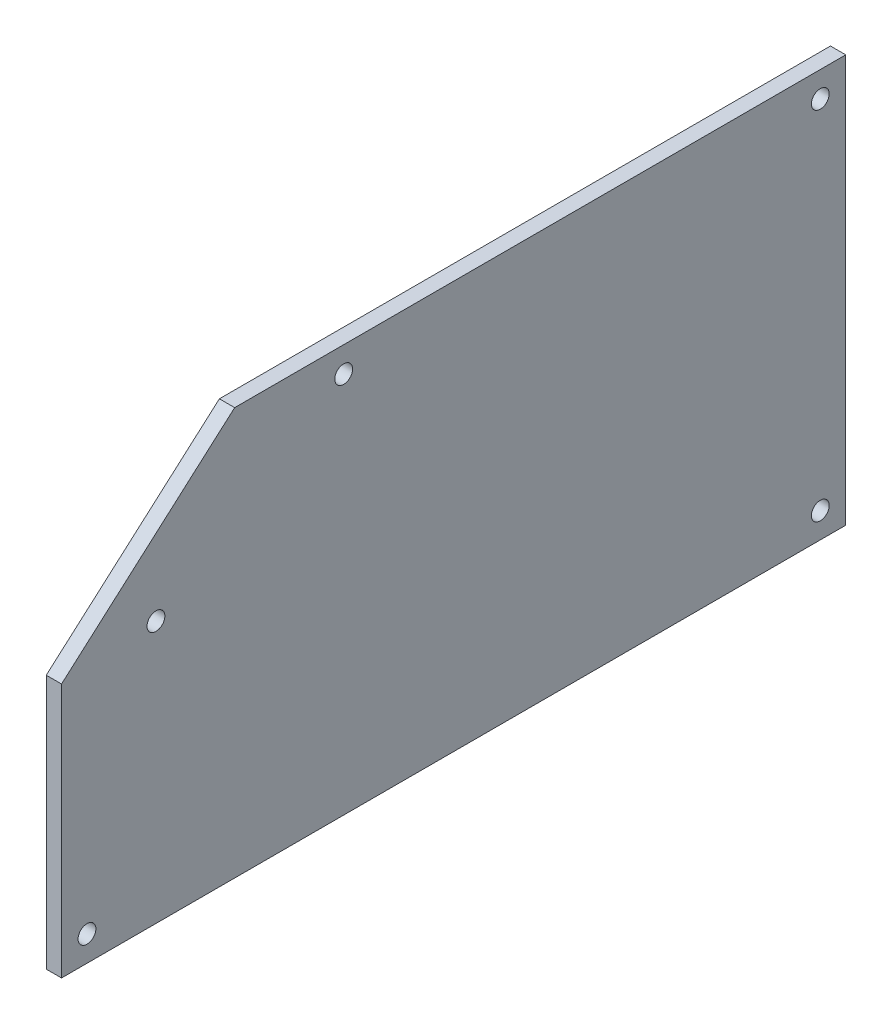
ISO-10303-21;
HEADER;
FILE_DESCRIPTION(('STEP AP214'),'2;1');
FILE_NAME('part.step','',(''),(''),'','','');
FILE_SCHEMA(('AUTOMOTIVE_DESIGN { 1 0 10303 214 1 1 1 1 }'));
ENDSEC;
DATA;
#1=APPLICATION_CONTEXT('core data for automotive mechanical design processes');
#2=APPLICATION_PROTOCOL_DEFINITION('international standard','automotive_design',2000,#1);
#3=PRODUCT_CONTEXT('',#1,'mechanical');
#4=PRODUCT('Part','Part','',(#3));
#5=PRODUCT_RELATED_PRODUCT_CATEGORY('part','',(#4));
#6=PRODUCT_DEFINITION_FORMATION('','',#4);
#7=PRODUCT_DEFINITION_CONTEXT('part definition',#1,'design');
#8=PRODUCT_DEFINITION('design','',#6,#7);
#9=PRODUCT_DEFINITION_SHAPE('','',#8);
#10=(LENGTH_UNIT() NAMED_UNIT(*) SI_UNIT(.MILLI.,.METRE.));
#11=(NAMED_UNIT(*) PLANE_ANGLE_UNIT() SI_UNIT($,.RADIAN.));
#12=(NAMED_UNIT(*) SI_UNIT($,.STERADIAN.) SOLID_ANGLE_UNIT());
#13=UNCERTAINTY_MEASURE_WITH_UNIT(LENGTH_MEASURE(1.E-05),#10,'distance_accuracy_value','');
#14=(GEOMETRIC_REPRESENTATION_CONTEXT(3) GLOBAL_UNCERTAINTY_ASSIGNED_CONTEXT((#13)) GLOBAL_UNIT_ASSIGNED_CONTEXT((#10,
#11,#12)) REPRESENTATION_CONTEXT('',''));
#15=CARTESIAN_POINT('',(0.,0.,0.));
#16=DIRECTION('',(0.,0.,1.));
#17=DIRECTION('',(1.,0.,0.));
#18=AXIS2_PLACEMENT_3D('',#15,#16,#17);
#19=CARTESIAN_POINT('',(3.,0.,-154.));
#20=DIRECTION('',(0.,1.,0.));
#21=DIRECTION('',(0.,0.,1.));
#22=AXIS2_PLACEMENT_3D('',#19,#20,#21);
#23=PLANE('',#22);
#24=DIRECTION('',(0.,0.,-1.));
#25=VECTOR('',#24,1.);
#26=CARTESIAN_POINT('',(0.,0.,-154.));
#27=LINE('',#26,#25);
#28=CARTESIAN_POINT('',(0.,0.,0.));
#29=VERTEX_POINT('',#28);
#30=CARTESIAN_POINT('',(0.,0.,-154.));
#31=VERTEX_POINT('',#30);
#32=EDGE_CURVE('E114',#29,#31,#27,.T.);
#33=ORIENTED_EDGE('',*,*,#32,.T.);
#34=DIRECTION('',(-1.,0.,0.));
#35=VECTOR('',#34,1.);
#36=CARTESIAN_POINT('',(3.,0.,-154.));
#37=LINE('',#36,#35);
#38=CARTESIAN_POINT('',(3.,0.,-154.));
#39=VERTEX_POINT('',#38);
#40=EDGE_CURVE('E11',#39,#31,#37,.T.);
#41=ORIENTED_EDGE('',*,*,#40,.F.);
#42=DIRECTION('',(0.,0.,-1.));
#43=VECTOR('',#42,1.);
#44=CARTESIAN_POINT('',(3.,0.,-154.));
#45=LINE('',#44,#43);
#46=CARTESIAN_POINT('',(3.,0.,0.));
#47=VERTEX_POINT('',#46);
#48=EDGE_CURVE('E123',#47,#39,#45,.T.);
#49=ORIENTED_EDGE('',*,*,#48,.F.);
#50=DIRECTION('',(-1.,0.,0.));
#51=VECTOR('',#50,1.);
#52=CARTESIAN_POINT('',(3.,0.,0.));
#53=LINE('',#52,#51);
#54=EDGE_CURVE('E110',#47,#29,#53,.T.);
#55=ORIENTED_EDGE('',*,*,#54,.T.);
#56=EDGE_LOOP('',(#33,#41,#49,#55));
#57=FACE_BOUND('',#56,.T.);
#58=ADVANCED_FACE('F40',(#57),#23,.F.);
#59=CARTESIAN_POINT('',(3.,80.,-154.));
#60=DIRECTION('',(0.,0.,1.));
#61=DIRECTION('',(1.,0.,0.));
#62=AXIS2_PLACEMENT_3D('',#59,#60,#61);
#63=PLANE('',#62);
#64=DIRECTION('',(0.,1.,0.));
#65=VECTOR('',#64,1.);
#66=CARTESIAN_POINT('',(0.,80.,-154.));
#67=LINE('',#66,#65);
#68=CARTESIAN_POINT('',(0.,80.,-154.));
#69=VERTEX_POINT('',#68);
#70=EDGE_CURVE('E117',#31,#69,#67,.T.);
#71=ORIENTED_EDGE('',*,*,#70,.T.);
#72=DIRECTION('',(-1.,0.,0.));
#73=VECTOR('',#72,1.);
#74=CARTESIAN_POINT('',(3.,80.,-154.));
#75=LINE('',#74,#73);
#76=CARTESIAN_POINT('',(3.,80.,-154.));
#77=VERTEX_POINT('',#76);
#78=EDGE_CURVE('E48',#77,#69,#75,.T.);
#79=ORIENTED_EDGE('',*,*,#78,.F.);
#80=DIRECTION('',(0.,1.,0.));
#81=VECTOR('',#80,1.);
#82=CARTESIAN_POINT('',(3.,80.,-154.));
#83=LINE('',#82,#81);
#84=EDGE_CURVE('E90',#39,#77,#83,.T.);
#85=ORIENTED_EDGE('',*,*,#84,.F.);
#86=ORIENTED_EDGE('',*,*,#40,.T.);
#87=EDGE_LOOP('',(#71,#79,#85,#86));
#88=FACE_BOUND('',#87,.T.);
#89=ADVANCED_FACE('F143',(#88),#63,.F.);
#90=CARTESIAN_POINT('',(3.,80.,-34.));
#91=DIRECTION('',(0.,-1.,0.));
#92=DIRECTION('',(0.,0.,-1.));
#93=AXIS2_PLACEMENT_3D('',#90,#91,#92);
#94=PLANE('',#93);
#95=DIRECTION('',(0.,0.,1.));
#96=VECTOR('',#95,1.);
#97=CARTESIAN_POINT('',(0.,80.,-34.));
#98=LINE('',#97,#96);
#99=CARTESIAN_POINT('',(0.,80.,-34.));
#100=VERTEX_POINT('',#99);
#101=EDGE_CURVE('E105',#69,#100,#98,.T.);
#102=ORIENTED_EDGE('',*,*,#101,.T.);
#103=DIRECTION('',(-1.,0.,0.));
#104=VECTOR('',#103,1.);
#105=CARTESIAN_POINT('',(3.,80.,-34.));
#106=LINE('',#105,#104);
#107=CARTESIAN_POINT('',(3.,80.,-34.));
#108=VERTEX_POINT('',#107);
#109=EDGE_CURVE('E102',#108,#100,#106,.T.);
#110=ORIENTED_EDGE('',*,*,#109,.F.);
#111=DIRECTION('',(0.,0.,1.));
#112=VECTOR('',#111,1.);
#113=CARTESIAN_POINT('',(3.,80.,-34.));
#114=LINE('',#113,#112);
#115=EDGE_CURVE('E94',#77,#108,#114,.T.);
#116=ORIENTED_EDGE('',*,*,#115,.F.);
#117=ORIENTED_EDGE('',*,*,#78,.T.);
#118=EDGE_LOOP('',(#102,#110,#116,#117));
#119=FACE_BOUND('',#118,.T.);
#120=ADVANCED_FACE('F103',(#119),#94,.F.);
#121=CARTESIAN_POINT('',(3.,50.,0.));
#122=DIRECTION('',(0.,-0.749837855365093,-0.661621637086846));
#123=DIRECTION('',(0.,0.661621637086846,-0.749837855365093));
#124=AXIS2_PLACEMENT_3D('',#121,#122,#123);
#125=PLANE('',#124);
#126=DIRECTION('',(0.,-0.661621637086846,0.749837855365093));
#127=VECTOR('',#126,1.);
#128=CARTESIAN_POINT('',(0.,50.,0.));
#129=LINE('',#128,#127);
#130=CARTESIAN_POINT('',(0.,50.,0.));
#131=VERTEX_POINT('',#130);
#132=EDGE_CURVE('E76',#100,#131,#129,.T.);
#133=ORIENTED_EDGE('',*,*,#132,.T.);
#134=DIRECTION('',(-1.,0.,0.));
#135=VECTOR('',#134,1.);
#136=CARTESIAN_POINT('',(3.,50.,0.));
#137=LINE('',#136,#135);
#138=CARTESIAN_POINT('',(3.,50.,0.));
#139=VERTEX_POINT('',#138);
#140=EDGE_CURVE('E106',#139,#131,#137,.T.);
#141=ORIENTED_EDGE('',*,*,#140,.F.);
#142=DIRECTION('',(0.,-0.661621637086846,0.749837855365093));
#143=VECTOR('',#142,1.);
#144=CARTESIAN_POINT('',(3.,50.,0.));
#145=LINE('',#144,#143);
#146=EDGE_CURVE('E98',#108,#139,#145,.T.);
#147=ORIENTED_EDGE('',*,*,#146,.F.);
#148=ORIENTED_EDGE('',*,*,#109,.T.);
#149=EDGE_LOOP('',(#133,#141,#147,#148));
#150=FACE_BOUND('',#149,.T.);
#151=ADVANCED_FACE('F108',(#150),#125,.F.);
#152=CARTESIAN_POINT('',(3.,0.,0.));
#153=DIRECTION('',(0.,0.,-1.));
#154=DIRECTION('',(-1.,0.,0.));
#155=AXIS2_PLACEMENT_3D('',#152,#153,#154);
#156=PLANE('',#155);
#157=DIRECTION('',(0.,-1.,0.));
#158=VECTOR('',#157,1.);
#159=CARTESIAN_POINT('',(0.,0.,0.));
#160=LINE('',#159,#158);
#161=EDGE_CURVE('E82',#131,#29,#160,.T.);
#162=ORIENTED_EDGE('',*,*,#161,.T.);
#163=ORIENTED_EDGE('',*,*,#54,.F.);
#164=DIRECTION('',(0.,-1.,0.));
#165=VECTOR('',#164,1.);
#166=CARTESIAN_POINT('',(3.,0.,0.));
#167=LINE('',#166,#165);
#168=EDGE_CURVE('E56',#139,#47,#167,.T.);
#169=ORIENTED_EDGE('',*,*,#168,.F.);
#170=ORIENTED_EDGE('',*,*,#140,.T.);
#171=EDGE_LOOP('',(#162,#163,#169,#170));
#172=FACE_BOUND('',#171,.T.);
#173=ADVANCED_FACE('F131',(#172),#156,.F.);
#174=CARTESIAN_POINT('',(3.,0.,0.));
#175=DIRECTION('',(-1.,0.,0.));
#176=DIRECTION('',(0.,0.,1.));
#177=AXIS2_PLACEMENT_3D('',#174,#175,#176);
#178=PLANE('',#177);
#179=CARTESIAN_POINT('',(3.,75.,-149.));
#180=DIRECTION('',(-1.,0.,0.));
#181=DIRECTION('',(0.,0.,1.));
#182=AXIS2_PLACEMENT_3D('',#179,#180,#181);
#183=CIRCLE('',#182,1.75000000000001);
#184=CARTESIAN_POINT('',(3.,75.,-147.25));
#185=VERTEX_POINT('',#184);
#186=EDGE_CURVE('E268',#185,#185,#183,.T.);
#187=ORIENTED_EDGE('',*,*,#186,.T.);
#188=EDGE_LOOP('',(#187));
#189=FACE_BOUND('',#188,.T.);
#190=CARTESIAN_POINT('',(3.,5.00000000000001,-5.));
#191=DIRECTION('',(-1.,0.,0.));
#192=DIRECTION('',(0.,0.,1.));
#193=AXIS2_PLACEMENT_3D('',#190,#191,#192);
#194=CIRCLE('',#193,1.75);
#195=CARTESIAN_POINT('',(3.,5.00000000000001,-3.25));
#196=VERTEX_POINT('',#195);
#197=EDGE_CURVE('E284',#196,#196,#194,.T.);
#198=ORIENTED_EDGE('',*,*,#197,.T.);
#199=EDGE_LOOP('',(#198));
#200=FACE_BOUND('',#199,.T.);
#201=CARTESIAN_POINT('',(3.,75.,-55.4071890054761));
#202=DIRECTION('',(-1.,0.,0.));
#203=DIRECTION('',(0.,0.,1.));
#204=AXIS2_PLACEMENT_3D('',#201,#202,#203);
#205=CIRCLE('',#204,1.75);
#206=CARTESIAN_POINT('',(3.,75.,-53.6571890054761));
#207=VERTEX_POINT('',#206);
#208=EDGE_CURVE('E298',#207,#207,#205,.T.);
#209=ORIENTED_EDGE('',*,*,#208,.T.);
#210=EDGE_LOOP('',(#209));
#211=FACE_BOUND('',#210,.T.);
#212=CARTESIAN_POINT('',(3.,51.4229936078831,-18.5408302684078));
#213=DIRECTION('',(-1.,0.,0.));
#214=DIRECTION('',(0.,0.,1.));
#215=AXIS2_PLACEMENT_3D('',#212,#213,#214);
#216=CIRCLE('',#215,1.75);
#217=CARTESIAN_POINT('',(3.,51.4229936078831,-16.7908302684078));
#218=VERTEX_POINT('',#217);
#219=EDGE_CURVE('E279',#218,#218,#216,.T.);
#220=ORIENTED_EDGE('',*,*,#219,.T.);
#221=EDGE_LOOP('',(#220));
#222=FACE_BOUND('',#221,.T.);
#223=CARTESIAN_POINT('',(3.,5.,-149.));
#224=DIRECTION('',(-1.,0.,0.));
#225=DIRECTION('',(0.,0.,1.));
#226=AXIS2_PLACEMENT_3D('',#223,#224,#225);
#227=CIRCLE('',#226,1.75000000000001);
#228=CARTESIAN_POINT('',(3.,5.,-147.25));
#229=VERTEX_POINT('',#228);
#230=EDGE_CURVE('E118',#229,#229,#227,.T.);
#231=ORIENTED_EDGE('',*,*,#230,.T.);
#232=EDGE_LOOP('',(#231));
#233=FACE_BOUND('',#232,.T.);
#234=ORIENTED_EDGE('',*,*,#48,.T.);
#235=ORIENTED_EDGE('',*,*,#84,.T.);
#236=ORIENTED_EDGE('',*,*,#115,.T.);
#237=ORIENTED_EDGE('',*,*,#146,.T.);
#238=ORIENTED_EDGE('',*,*,#168,.T.);
#239=EDGE_LOOP('',(#234,#235,#236,#237,#238));
#240=FACE_BOUND('',#239,.T.);
#241=ADVANCED_FACE('F96',(#189,#200,#211,#222,#233,#240),#178,.F.);
#242=CARTESIAN_POINT('',(0.,0.,0.));
#243=DIRECTION('',(-1.,0.,0.));
#244=DIRECTION('',(0.,0.,1.));
#245=AXIS2_PLACEMENT_3D('',#242,#243,#244);
#246=PLANE('',#245);
#247=CARTESIAN_POINT('',(0.,75.,-149.));
#248=DIRECTION('',(-1.,0.,0.));
#249=DIRECTION('',(0.,0.,1.));
#250=AXIS2_PLACEMENT_3D('',#247,#248,#249);
#251=CIRCLE('',#250,1.75000000000001);
#252=CARTESIAN_POINT('',(0.,75.,-147.25));
#253=VERTEX_POINT('',#252);
#254=EDGE_CURVE('E271',#253,#253,#251,.T.);
#255=ORIENTED_EDGE('',*,*,#254,.F.);
#256=EDGE_LOOP('',(#255));
#257=FACE_BOUND('',#256,.T.);
#258=CARTESIAN_POINT('',(0.,5.00000000000001,-5.));
#259=DIRECTION('',(-1.,0.,0.));
#260=DIRECTION('',(0.,0.,1.));
#261=AXIS2_PLACEMENT_3D('',#258,#259,#260);
#262=CIRCLE('',#261,1.75);
#263=CARTESIAN_POINT('',(0.,5.00000000000001,-3.25));
#264=VERTEX_POINT('',#263);
#265=EDGE_CURVE('E276',#264,#264,#262,.T.);
#266=ORIENTED_EDGE('',*,*,#265,.F.);
#267=EDGE_LOOP('',(#266));
#268=FACE_BOUND('',#267,.T.);
#269=CARTESIAN_POINT('',(0.,75.,-55.4071890054761));
#270=DIRECTION('',(-1.,0.,0.));
#271=DIRECTION('',(0.,0.,1.));
#272=AXIS2_PLACEMENT_3D('',#269,#270,#271);
#273=CIRCLE('',#272,1.75);
#274=CARTESIAN_POINT('',(0.,75.,-53.6571890054761));
#275=VERTEX_POINT('',#274);
#276=EDGE_CURVE('E287',#275,#275,#273,.T.);
#277=ORIENTED_EDGE('',*,*,#276,.F.);
#278=EDGE_LOOP('',(#277));
#279=FACE_BOUND('',#278,.T.);
#280=CARTESIAN_POINT('',(0.,51.4229936078831,-18.5408302684078));
#281=DIRECTION('',(-1.,0.,0.));
#282=DIRECTION('',(0.,0.,1.));
#283=AXIS2_PLACEMENT_3D('',#280,#281,#282);
#284=CIRCLE('',#283,1.75);
#285=CARTESIAN_POINT('',(0.,51.4229936078831,-16.7908302684078));
#286=VERTEX_POINT('',#285);
#287=EDGE_CURVE('E303',#286,#286,#284,.T.);
#288=ORIENTED_EDGE('',*,*,#287,.F.);
#289=EDGE_LOOP('',(#288));
#290=FACE_BOUND('',#289,.T.);
#291=CARTESIAN_POINT('',(0.,5.,-149.));
#292=DIRECTION('',(-1.,0.,0.));
#293=DIRECTION('',(0.,0.,1.));
#294=AXIS2_PLACEMENT_3D('',#291,#292,#293);
#295=CIRCLE('',#294,1.75000000000001);
#296=CARTESIAN_POINT('',(0.,5.,-147.25));
#297=VERTEX_POINT('',#296);
#298=EDGE_CURVE('E272',#297,#297,#295,.T.);
#299=ORIENTED_EDGE('',*,*,#298,.F.);
#300=EDGE_LOOP('',(#299));
#301=FACE_BOUND('',#300,.T.);
#302=ORIENTED_EDGE('',*,*,#32,.F.);
#303=ORIENTED_EDGE('',*,*,#161,.F.);
#304=ORIENTED_EDGE('',*,*,#132,.F.);
#305=ORIENTED_EDGE('',*,*,#101,.F.);
#306=ORIENTED_EDGE('',*,*,#70,.F.);
#307=EDGE_LOOP('',(#302,#303,#304,#305,#306));
#308=FACE_BOUND('',#307,.T.);
#309=ADVANCED_FACE('F127',(#257,#268,#279,#290,#301,#308),#246,.T.);
#310=CARTESIAN_POINT('',(3.,5.,-149.));
#311=DIRECTION('',(-1.,0.,0.));
#312=DIRECTION('',(0.,0.,1.));
#313=AXIS2_PLACEMENT_3D('',#310,#311,#312);
#314=CYLINDRICAL_SURFACE('',#313,1.75000000000001);
#315=ORIENTED_EDGE('',*,*,#230,.F.);
#316=EDGE_LOOP('',(#315));
#317=FACE_BOUND('',#316,.T.);
#318=ORIENTED_EDGE('',*,*,#298,.T.);
#319=EDGE_LOOP('',(#318));
#320=FACE_BOUND('',#319,.T.);
#321=ADVANCED_FACE('F181',(#317,#320),#314,.F.);
#322=CARTESIAN_POINT('',(3.,51.4229936078831,-18.5408302684078));
#323=DIRECTION('',(-1.,0.,0.));
#324=DIRECTION('',(0.,0.,1.));
#325=AXIS2_PLACEMENT_3D('',#322,#323,#324);
#326=CYLINDRICAL_SURFACE('',#325,1.75);
#327=ORIENTED_EDGE('',*,*,#219,.F.);
#328=EDGE_LOOP('',(#327));
#329=FACE_BOUND('',#328,.T.);
#330=ORIENTED_EDGE('',*,*,#287,.T.);
#331=EDGE_LOOP('',(#330));
#332=FACE_BOUND('',#331,.T.);
#333=ADVANCED_FACE('F191',(#329,#332),#326,.F.);
#334=CARTESIAN_POINT('',(3.,75.,-55.4071890054761));
#335=DIRECTION('',(-1.,0.,0.));
#336=DIRECTION('',(0.,0.,1.));
#337=AXIS2_PLACEMENT_3D('',#334,#335,#336);
#338=CYLINDRICAL_SURFACE('',#337,1.75);
#339=ORIENTED_EDGE('',*,*,#208,.F.);
#340=EDGE_LOOP('',(#339));
#341=FACE_BOUND('',#340,.T.);
#342=ORIENTED_EDGE('',*,*,#276,.T.);
#343=EDGE_LOOP('',(#342));
#344=FACE_BOUND('',#343,.T.);
#345=ADVANCED_FACE('F202',(#341,#344),#338,.F.);
#346=CARTESIAN_POINT('',(3.,5.00000000000001,-5.));
#347=DIRECTION('',(-1.,0.,0.));
#348=DIRECTION('',(0.,0.,1.));
#349=AXIS2_PLACEMENT_3D('',#346,#347,#348);
#350=CYLINDRICAL_SURFACE('',#349,1.75);
#351=ORIENTED_EDGE('',*,*,#197,.F.);
#352=EDGE_LOOP('',(#351));
#353=FACE_BOUND('',#352,.T.);
#354=ORIENTED_EDGE('',*,*,#265,.T.);
#355=EDGE_LOOP('',(#354));
#356=FACE_BOUND('',#355,.T.);
#357=ADVANCED_FACE('F213',(#353,#356),#350,.F.);
#358=CARTESIAN_POINT('',(3.,75.,-149.));
#359=DIRECTION('',(-1.,0.,0.));
#360=DIRECTION('',(0.,0.,1.));
#361=AXIS2_PLACEMENT_3D('',#358,#359,#360);
#362=CYLINDRICAL_SURFACE('',#361,1.75000000000001);
#363=ORIENTED_EDGE('',*,*,#186,.F.);
#364=EDGE_LOOP('',(#363));
#365=FACE_BOUND('',#364,.T.);
#366=ORIENTED_EDGE('',*,*,#254,.T.);
#367=EDGE_LOOP('',(#366));
#368=FACE_BOUND('',#367,.T.);
#369=ADVANCED_FACE('F224',(#365,#368),#362,.F.);
#370=CLOSED_SHELL('',(#58,#89,#120,#151,#173,#241,#309,#321,#333,#345,#357,#369));
#371=MANIFOLD_SOLID_BREP('B2',#370);
#372=ADVANCED_BREP_SHAPE_REPRESENTATION('',(#18,#371),#14);
#373=SHAPE_DEFINITION_REPRESENTATION(#9,#372);
ENDSEC;
END-ISO-10303-21;
